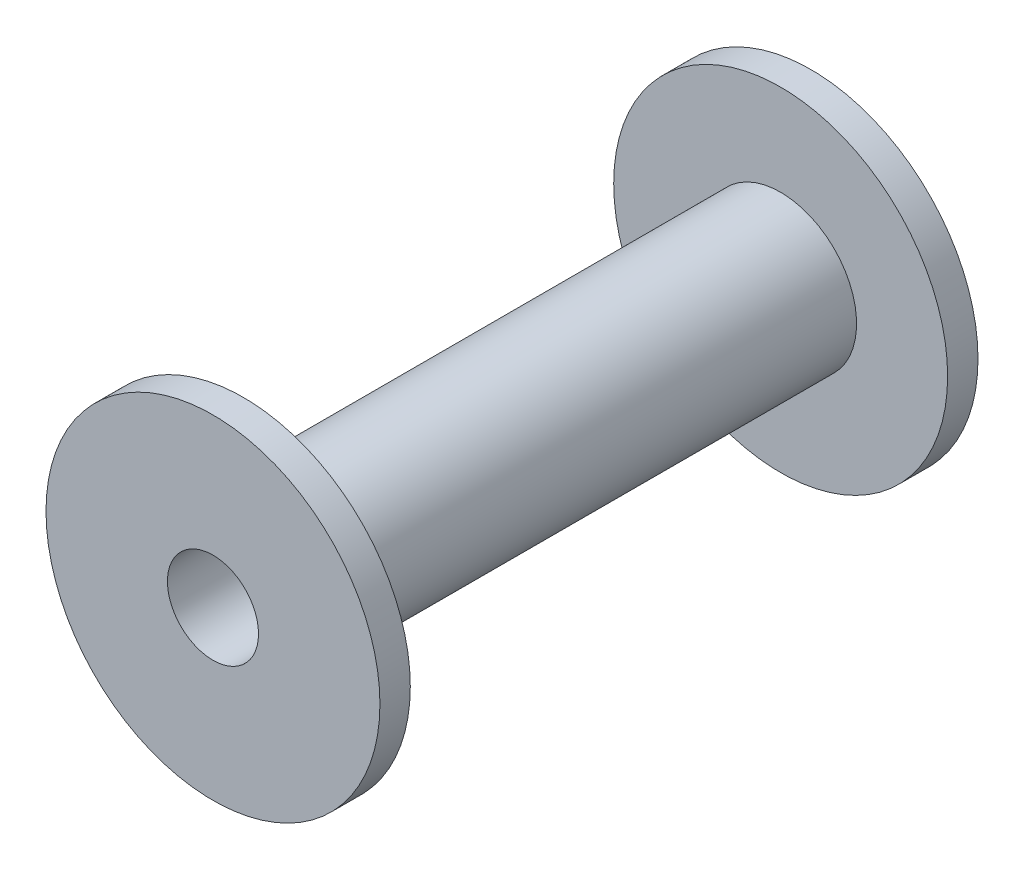
ISO-10303-21;
HEADER;
FILE_DESCRIPTION(('STEP AP214'),'2;1');
FILE_NAME('part.step','',(''),(''),'','','');
FILE_SCHEMA(('AUTOMOTIVE_DESIGN { 1 0 10303 214 1 1 1 1 }'));
ENDSEC;
DATA;
#1=APPLICATION_CONTEXT('core data for automotive mechanical design processes');
#2=APPLICATION_PROTOCOL_DEFINITION('international standard','automotive_design',2000,#1);
#3=PRODUCT_CONTEXT('',#1,'mechanical');
#4=PRODUCT('Part','Part','',(#3));
#5=PRODUCT_RELATED_PRODUCT_CATEGORY('part','',(#4));
#6=PRODUCT_DEFINITION_FORMATION('','',#4);
#7=PRODUCT_DEFINITION_CONTEXT('part definition',#1,'design');
#8=PRODUCT_DEFINITION('design','',#6,#7);
#9=PRODUCT_DEFINITION_SHAPE('','',#8);
#10=(LENGTH_UNIT() NAMED_UNIT(*) SI_UNIT(.MILLI.,.METRE.));
#11=(NAMED_UNIT(*) PLANE_ANGLE_UNIT() SI_UNIT($,.RADIAN.));
#12=(NAMED_UNIT(*) SI_UNIT($,.STERADIAN.) SOLID_ANGLE_UNIT());
#13=UNCERTAINTY_MEASURE_WITH_UNIT(LENGTH_MEASURE(1.E-05),#10,'distance_accuracy_value','');
#14=(GEOMETRIC_REPRESENTATION_CONTEXT(3) GLOBAL_UNCERTAINTY_ASSIGNED_CONTEXT((#13)) GLOBAL_UNIT_ASSIGNED_CONTEXT((#10,
#11,#12)) REPRESENTATION_CONTEXT('',''));
#15=CARTESIAN_POINT('',(0.,0.,0.));
#16=DIRECTION('',(0.,0.,1.));
#17=DIRECTION('',(1.,0.,0.));
#18=AXIS2_PLACEMENT_3D('',#15,#16,#17);
#19=CARTESIAN_POINT('',(0.,0.,9.85));
#20=DIRECTION('',(0.,0.,-1.));
#21=DIRECTION('',(-1.,0.,0.));
#22=AXIS2_PLACEMENT_3D('',#19,#20,#21);
#23=CYLINDRICAL_SURFACE('',#22,2.5);
#24=CARTESIAN_POINT('',(0.,0.,8.85));
#25=DIRECTION('',(0.,0.,1.));
#26=DIRECTION('',(1.,0.,0.));
#27=AXIS2_PLACEMENT_3D('',#24,#25,#26);
#28=CIRCLE('',#27,2.5);
#29=CARTESIAN_POINT('',(2.5,0.,8.85));
#30=VERTEX_POINT('',#29);
#31=EDGE_CURVE('E48',#30,#30,#28,.T.);
#32=ORIENTED_EDGE('',*,*,#31,.F.);
#33=EDGE_LOOP('',(#32));
#34=FACE_BOUND('',#33,.T.);
#35=CARTESIAN_POINT('',(0.,0.,-8.85));
#36=DIRECTION('',(0.,0.,-1.));
#37=DIRECTION('',(-1.,0.,0.));
#38=AXIS2_PLACEMENT_3D('',#35,#36,#37);
#39=CIRCLE('',#38,2.5);
#40=CARTESIAN_POINT('',(-2.5,0.,-8.85));
#41=VERTEX_POINT('',#40);
#42=EDGE_CURVE('E10',#41,#41,#39,.T.);
#43=ORIENTED_EDGE('',*,*,#42,.F.);
#44=EDGE_LOOP('',(#43));
#45=FACE_BOUND('',#44,.T.);
#46=ADVANCED_FACE('F41',(#34,#45),#23,.T.);
#47=CARTESIAN_POINT('',(0.,0.,9.85));
#48=DIRECTION('',(0.,0.,1.));
#49=DIRECTION('',(1.,0.,0.));
#50=AXIS2_PLACEMENT_3D('',#47,#48,#49);
#51=PLANE('',#50);
#52=CARTESIAN_POINT('',(0.,0.,9.85));
#53=DIRECTION('',(0.,0.,1.));
#54=DIRECTION('',(1.,0.,0.));
#55=AXIS2_PLACEMENT_3D('',#52,#53,#54);
#56=CIRCLE('',#55,1.5);
#57=CARTESIAN_POINT('',(1.5,0.,9.85));
#58=VERTEX_POINT('',#57);
#59=EDGE_CURVE('E53',#58,#58,#56,.T.);
#60=ORIENTED_EDGE('',*,*,#59,.F.);
#61=EDGE_LOOP('',(#60));
#62=FACE_BOUND('',#61,.T.);
#63=CARTESIAN_POINT('',(0.,0.,9.85));
#64=DIRECTION('',(0.,0.,1.));
#65=DIRECTION('',(1.,0.,0.));
#66=AXIS2_PLACEMENT_3D('',#63,#64,#65);
#67=CIRCLE('',#66,5.5);
#68=CARTESIAN_POINT('',(5.5,0.,9.85));
#69=VERTEX_POINT('',#68);
#70=EDGE_CURVE('E61',#69,#69,#67,.T.);
#71=ORIENTED_EDGE('',*,*,#70,.T.);
#72=EDGE_LOOP('',(#71));
#73=FACE_BOUND('',#72,.T.);
#74=ADVANCED_FACE('F102',(#62,#73),#51,.T.);
#75=CARTESIAN_POINT('',(0.,0.,9.85));
#76=DIRECTION('',(0.,0.,-1.));
#77=DIRECTION('',(-1.,0.,0.));
#78=AXIS2_PLACEMENT_3D('',#75,#76,#77);
#79=CYLINDRICAL_SURFACE('',#78,1.5);
#80=ORIENTED_EDGE('',*,*,#59,.T.);
#81=EDGE_LOOP('',(#80));
#82=FACE_BOUND('',#81,.T.);
#83=CARTESIAN_POINT('',(0.,0.,-9.85));
#84=DIRECTION('',(0.,0.,1.));
#85=DIRECTION('',(1.,0.,0.));
#86=AXIS2_PLACEMENT_3D('',#83,#84,#85);
#87=CIRCLE('',#86,1.5);
#88=CARTESIAN_POINT('',(1.5,0.,-9.85));
#89=VERTEX_POINT('',#88);
#90=EDGE_CURVE('E65',#89,#89,#87,.T.);
#91=ORIENTED_EDGE('',*,*,#90,.F.);
#92=EDGE_LOOP('',(#91));
#93=FACE_BOUND('',#92,.T.);
#94=ADVANCED_FACE('F107',(#82,#93),#79,.F.);
#95=CARTESIAN_POINT('',(0.,0.,8.85));
#96=DIRECTION('',(0.,0.,1.));
#97=DIRECTION('',(1.,0.,0.));
#98=AXIS2_PLACEMENT_3D('',#95,#96,#97);
#99=CYLINDRICAL_SURFACE('',#98,5.5);
#100=CARTESIAN_POINT('',(0.,0.,8.85));
#101=DIRECTION('',(0.,0.,1.));
#102=DIRECTION('',(1.,0.,0.));
#103=AXIS2_PLACEMENT_3D('',#100,#101,#102);
#104=CIRCLE('',#103,5.5);
#105=CARTESIAN_POINT('',(5.5,0.,8.85));
#106=VERTEX_POINT('',#105);
#107=EDGE_CURVE('E58',#106,#106,#104,.T.);
#108=ORIENTED_EDGE('',*,*,#107,.T.);
#109=EDGE_LOOP('',(#108));
#110=FACE_BOUND('',#109,.T.);
#111=ORIENTED_EDGE('',*,*,#70,.F.);
#112=EDGE_LOOP('',(#111));
#113=FACE_BOUND('',#112,.T.);
#114=ADVANCED_FACE('F99',(#110,#113),#99,.T.);
#115=CARTESIAN_POINT('',(0.,0.,8.85));
#116=DIRECTION('',(0.,0.,1.));
#117=DIRECTION('',(1.,0.,0.));
#118=AXIS2_PLACEMENT_3D('',#115,#116,#117);
#119=PLANE('',#118);
#120=ORIENTED_EDGE('',*,*,#31,.T.);
#121=EDGE_LOOP('',(#120));
#122=FACE_BOUND('',#121,.T.);
#123=ORIENTED_EDGE('',*,*,#107,.F.);
#124=EDGE_LOOP('',(#123));
#125=FACE_BOUND('',#124,.T.);
#126=ADVANCED_FACE('F91',(#122,#125),#119,.F.);
#127=CARTESIAN_POINT('',(0.,0.,-9.85));
#128=DIRECTION('',(0.,0.,-1.));
#129=DIRECTION('',(1.,0.,0.));
#130=AXIS2_PLACEMENT_3D('',#127,#128,#129);
#131=PLANE('',#130);
#132=ORIENTED_EDGE('',*,*,#90,.T.);
#133=EDGE_LOOP('',(#132));
#134=FACE_BOUND('',#133,.T.);
#135=CARTESIAN_POINT('',(0.,0.,-9.85));
#136=DIRECTION('',(0.,0.,1.));
#137=DIRECTION('',(1.,0.,0.));
#138=AXIS2_PLACEMENT_3D('',#135,#136,#137);
#139=CIRCLE('',#138,5.5);
#140=CARTESIAN_POINT('',(5.5,0.,-9.85));
#141=VERTEX_POINT('',#140);
#142=EDGE_CURVE('E73',#141,#141,#139,.T.);
#143=ORIENTED_EDGE('',*,*,#142,.F.);
#144=EDGE_LOOP('',(#143));
#145=FACE_BOUND('',#144,.T.);
#146=ADVANCED_FACE('F89',(#134,#145),#131,.T.);
#147=CARTESIAN_POINT('',(0.,0.,-8.85));
#148=DIRECTION('',(0.,0.,-1.));
#149=DIRECTION('',(1.,0.,0.));
#150=AXIS2_PLACEMENT_3D('',#147,#148,#149);
#151=PLANE('',#150);
#152=CARTESIAN_POINT('',(0.,0.,-8.85));
#153=DIRECTION('',(0.,0.,1.));
#154=DIRECTION('',(1.,0.,0.));
#155=AXIS2_PLACEMENT_3D('',#152,#153,#154);
#156=CIRCLE('',#155,5.5);
#157=CARTESIAN_POINT('',(5.5,0.,-8.85));
#158=VERTEX_POINT('',#157);
#159=EDGE_CURVE('E72',#158,#158,#156,.T.);
#160=ORIENTED_EDGE('',*,*,#159,.T.);
#161=EDGE_LOOP('',(#160));
#162=FACE_BOUND('',#161,.T.);
#163=ORIENTED_EDGE('',*,*,#42,.T.);
#164=EDGE_LOOP('',(#163));
#165=FACE_BOUND('',#164,.T.);
#166=ADVANCED_FACE('F81',(#162,#165),#151,.F.);
#167=CARTESIAN_POINT('',(0.,0.,-8.85));
#168=DIRECTION('',(0.,0.,-1.));
#169=DIRECTION('',(-1.,0.,0.));
#170=AXIS2_PLACEMENT_3D('',#167,#168,#169);
#171=CYLINDRICAL_SURFACE('',#170,5.5);
#172=ORIENTED_EDGE('',*,*,#159,.F.);
#173=EDGE_LOOP('',(#172));
#174=FACE_BOUND('',#173,.T.);
#175=ORIENTED_EDGE('',*,*,#142,.T.);
#176=EDGE_LOOP('',(#175));
#177=FACE_BOUND('',#176,.T.);
#178=ADVANCED_FACE('F83',(#174,#177),#171,.T.);
#179=CLOSED_SHELL('',(#46,#74,#94,#114,#126,#146,#166,#178));
#180=MANIFOLD_SOLID_BREP('B2',#179);
#181=ADVANCED_BREP_SHAPE_REPRESENTATION('',(#18,#180),#14);
#182=SHAPE_DEFINITION_REPRESENTATION(#9,#181);
ENDSEC;
END-ISO-10303-21;
